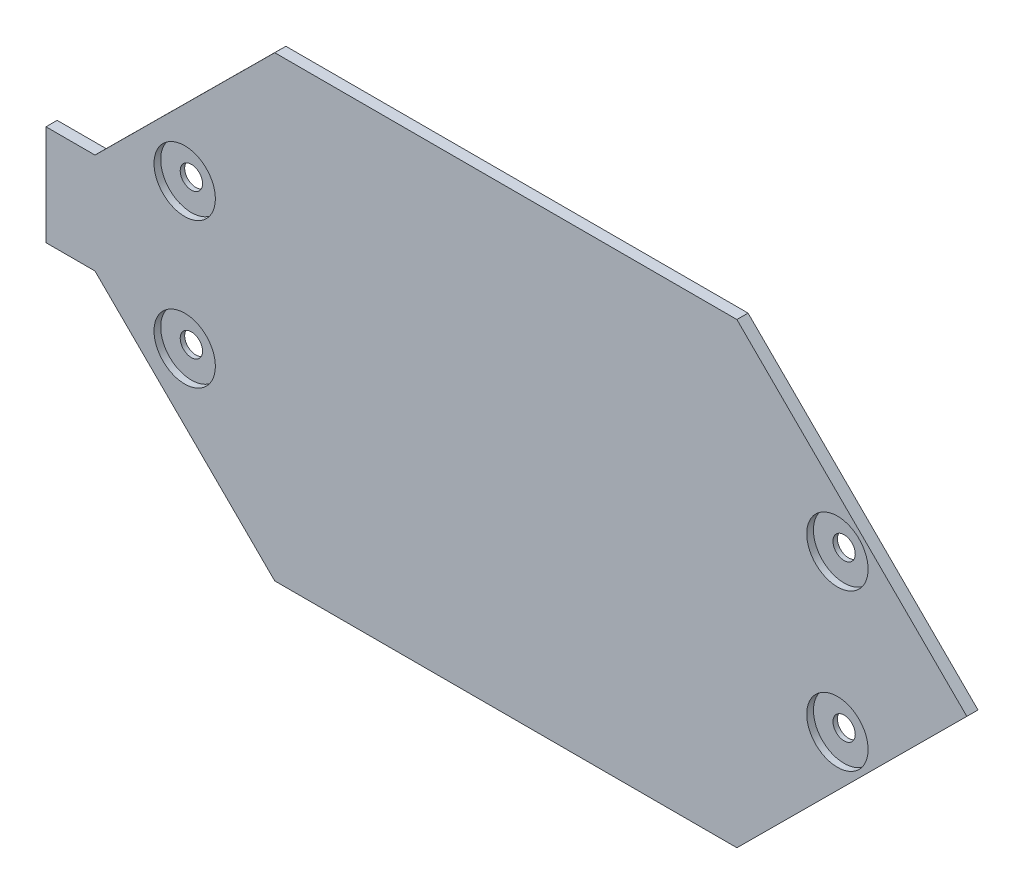
ISO-10303-21;
HEADER;
FILE_DESCRIPTION(('STEP AP214'),'2;1');
FILE_NAME('part.step','',(''),(''),'','','');
FILE_SCHEMA(('AUTOMOTIVE_DESIGN { 1 0 10303 214 1 1 1 1 }'));
ENDSEC;
DATA;
#1=APPLICATION_CONTEXT('core data for automotive mechanical design processes');
#2=APPLICATION_PROTOCOL_DEFINITION('international standard','automotive_design',2000,#1);
#3=PRODUCT_CONTEXT('',#1,'mechanical');
#4=PRODUCT('Part','Part','',(#3));
#5=PRODUCT_RELATED_PRODUCT_CATEGORY('part','',(#4));
#6=PRODUCT_DEFINITION_FORMATION('','',#4);
#7=PRODUCT_DEFINITION_CONTEXT('part definition',#1,'design');
#8=PRODUCT_DEFINITION('design','',#6,#7);
#9=PRODUCT_DEFINITION_SHAPE('','',#8);
#10=(LENGTH_UNIT() NAMED_UNIT(*) SI_UNIT(.MILLI.,.METRE.));
#11=(NAMED_UNIT(*) PLANE_ANGLE_UNIT() SI_UNIT($,.RADIAN.));
#12=(NAMED_UNIT(*) SI_UNIT($,.STERADIAN.) SOLID_ANGLE_UNIT());
#13=UNCERTAINTY_MEASURE_WITH_UNIT(LENGTH_MEASURE(1.E-05),#10,'distance_accuracy_value','');
#14=(GEOMETRIC_REPRESENTATION_CONTEXT(3) GLOBAL_UNCERTAINTY_ASSIGNED_CONTEXT((#13)) GLOBAL_UNIT_ASSIGNED_CONTEXT((#10,
#11,#12)) REPRESENTATION_CONTEXT('',''));
#15=CARTESIAN_POINT('',(0.,0.,0.));
#16=DIRECTION('',(0.,0.,1.));
#17=DIRECTION('',(1.,0.,0.));
#18=AXIS2_PLACEMENT_3D('',#15,#16,#17);
#19=CARTESIAN_POINT('',(24.5,59.53,1.));
#20=DIRECTION('',(0.,0.,-1.));
#21=DIRECTION('',(-1.,0.,0.));
#22=AXIS2_PLACEMENT_3D('',#19,#20,#21);
#23=CYLINDRICAL_SURFACE('',#22,1.);
#24=CARTESIAN_POINT('',(24.5,59.53,0.));
#25=DIRECTION('',(0.,0.,1.));
#26=DIRECTION('',(1.,0.,0.));
#27=AXIS2_PLACEMENT_3D('',#24,#25,#26);
#28=CIRCLE('',#27,1.);
#29=CARTESIAN_POINT('',(25.5,59.53,0.));
#30=VERTEX_POINT('',#29);
#31=EDGE_CURVE('E143',#30,#30,#28,.T.);
#32=ORIENTED_EDGE('',*,*,#31,.F.);
#33=EDGE_LOOP('',(#32));
#34=FACE_BOUND('',#33,.T.);
#35=CARTESIAN_POINT('',(24.5,59.53,0.4));
#36=DIRECTION('',(0.,0.,1.));
#37=DIRECTION('',(1.,0.,0.));
#38=AXIS2_PLACEMENT_3D('',#35,#36,#37);
#39=CIRCLE('',#38,1.);
#40=CARTESIAN_POINT('',(25.5,59.53,0.4));
#41=VERTEX_POINT('',#40);
#42=EDGE_CURVE('E38',#41,#41,#39,.T.);
#43=ORIENTED_EDGE('',*,*,#42,.T.);
#44=EDGE_LOOP('',(#43));
#45=FACE_BOUND('',#44,.T.);
#46=ADVANCED_FACE('F34',(#34,#45),#23,.F.);
#47=CARTESIAN_POINT('',(24.5,46.53,1.));
#48=DIRECTION('',(0.,0.,-1.));
#49=DIRECTION('',(-1.,0.,0.));
#50=AXIS2_PLACEMENT_3D('',#47,#48,#49);
#51=CYLINDRICAL_SURFACE('',#50,1.);
#52=CARTESIAN_POINT('',(24.5,46.53,0.));
#53=DIRECTION('',(0.,0.,1.));
#54=DIRECTION('',(1.,0.,0.));
#55=AXIS2_PLACEMENT_3D('',#52,#53,#54);
#56=CIRCLE('',#55,1.);
#57=CARTESIAN_POINT('',(25.5,46.53,0.));
#58=VERTEX_POINT('',#57);
#59=EDGE_CURVE('E191',#58,#58,#56,.T.);
#60=ORIENTED_EDGE('',*,*,#59,.F.);
#61=EDGE_LOOP('',(#60));
#62=FACE_BOUND('',#61,.T.);
#63=CARTESIAN_POINT('',(24.5,46.53,0.4));
#64=DIRECTION('',(0.,0.,1.));
#65=DIRECTION('',(1.,0.,0.));
#66=AXIS2_PLACEMENT_3D('',#63,#64,#65);
#67=CIRCLE('',#66,1.);
#68=CARTESIAN_POINT('',(25.5,46.53,0.4));
#69=VERTEX_POINT('',#68);
#70=EDGE_CURVE('E177',#69,#69,#67,.T.);
#71=ORIENTED_EDGE('',*,*,#70,.T.);
#72=EDGE_LOOP('',(#71));
#73=FACE_BOUND('',#72,.T.);
#74=ADVANCED_FACE('F240',(#62,#73),#51,.F.);
#75=CARTESIAN_POINT('',(83.,60.03,1.));
#76=DIRECTION('',(0.,0.,-1.));
#77=DIRECTION('',(-1.,0.,0.));
#78=AXIS2_PLACEMENT_3D('',#75,#76,#77);
#79=CYLINDRICAL_SURFACE('',#78,0.999999999999998);
#80=CARTESIAN_POINT('',(83.,60.03,0.));
#81=DIRECTION('',(0.,0.,1.));
#82=DIRECTION('',(1.,0.,0.));
#83=AXIS2_PLACEMENT_3D('',#80,#81,#82);
#84=CIRCLE('',#83,0.999999999999998);
#85=CARTESIAN_POINT('',(84.,60.03,0.));
#86=VERTEX_POINT('',#85);
#87=EDGE_CURVE('E186',#86,#86,#84,.T.);
#88=ORIENTED_EDGE('',*,*,#87,.F.);
#89=EDGE_LOOP('',(#88));
#90=FACE_BOUND('',#89,.T.);
#91=CARTESIAN_POINT('',(83.,60.03,0.4));
#92=DIRECTION('',(0.,0.,1.));
#93=DIRECTION('',(1.,0.,0.));
#94=AXIS2_PLACEMENT_3D('',#91,#92,#93);
#95=CIRCLE('',#94,0.999999999999998);
#96=CARTESIAN_POINT('',(84.,60.03,0.4));
#97=VERTEX_POINT('',#96);
#98=EDGE_CURVE('E174',#97,#97,#95,.T.);
#99=ORIENTED_EDGE('',*,*,#98,.T.);
#100=EDGE_LOOP('',(#99));
#101=FACE_BOUND('',#100,.T.);
#102=ADVANCED_FACE('F246',(#90,#101),#79,.F.);
#103=CARTESIAN_POINT('',(83.,46.03,1.));
#104=DIRECTION('',(0.,0.,-1.));
#105=DIRECTION('',(-1.,0.,0.));
#106=AXIS2_PLACEMENT_3D('',#103,#104,#105);
#107=CYLINDRICAL_SURFACE('',#106,0.999999999999998);
#108=CARTESIAN_POINT('',(83.,46.03,0.));
#109=DIRECTION('',(0.,0.,1.));
#110=DIRECTION('',(1.,0.,0.));
#111=AXIS2_PLACEMENT_3D('',#108,#109,#110);
#112=CIRCLE('',#111,0.999999999999998);
#113=CARTESIAN_POINT('',(84.,46.03,0.));
#114=VERTEX_POINT('',#113);
#115=EDGE_CURVE('E182',#114,#114,#112,.T.);
#116=ORIENTED_EDGE('',*,*,#115,.F.);
#117=EDGE_LOOP('',(#116));
#118=FACE_BOUND('',#117,.T.);
#119=CARTESIAN_POINT('',(83.,46.03,0.4));
#120=DIRECTION('',(0.,0.,1.));
#121=DIRECTION('',(1.,0.,0.));
#122=AXIS2_PLACEMENT_3D('',#119,#120,#121);
#123=CIRCLE('',#122,0.999999999999998);
#124=CARTESIAN_POINT('',(84.,46.03,0.4));
#125=VERTEX_POINT('',#124);
#126=EDGE_CURVE('E171',#125,#125,#123,.T.);
#127=ORIENTED_EDGE('',*,*,#126,.T.);
#128=EDGE_LOOP('',(#127));
#129=FACE_BOUND('',#128,.T.);
#130=ADVANCED_FACE('F253',(#118,#129),#107,.F.);
#131=CARTESIAN_POINT('',(0.,0.,1.));
#132=DIRECTION('',(0.,0.,1.));
#133=DIRECTION('',(1.,0.,0.));
#134=AXIS2_PLACEMENT_3D('',#131,#132,#133);
#135=PLANE('',#134);
#136=CARTESIAN_POINT('',(24.5,46.53,1.));
#137=DIRECTION('',(0.,0.,1.));
#138=DIRECTION('',(1.,0.,0.));
#139=AXIS2_PLACEMENT_3D('',#136,#137,#138);
#140=CIRCLE('',#139,2.75);
#141=CARTESIAN_POINT('',(27.25,46.53,1.));
#142=VERTEX_POINT('',#141);
#143=EDGE_CURVE('E417',#142,#142,#140,.T.);
#144=ORIENTED_EDGE('',*,*,#143,.F.);
#145=EDGE_LOOP('',(#144));
#146=FACE_BOUND('',#145,.T.);
#147=CARTESIAN_POINT('',(83.,60.03,1.));
#148=DIRECTION('',(0.,0.,1.));
#149=DIRECTION('',(1.,0.,0.));
#150=AXIS2_PLACEMENT_3D('',#147,#148,#149);
#151=CIRCLE('',#150,2.75000000000001);
#152=CARTESIAN_POINT('',(85.75,60.03,1.));
#153=VERTEX_POINT('',#152);
#154=EDGE_CURVE('E410',#153,#153,#151,.T.);
#155=ORIENTED_EDGE('',*,*,#154,.F.);
#156=EDGE_LOOP('',(#155));
#157=FACE_BOUND('',#156,.T.);
#158=CARTESIAN_POINT('',(83.,46.03,1.));
#159=DIRECTION('',(0.,0.,1.));
#160=DIRECTION('',(1.,0.,0.));
#161=AXIS2_PLACEMENT_3D('',#158,#159,#160);
#162=CIRCLE('',#161,2.75000000000001);
#163=CARTESIAN_POINT('',(85.75,46.03,1.));
#164=VERTEX_POINT('',#163);
#165=EDGE_CURVE('E422',#164,#164,#162,.T.);
#166=ORIENTED_EDGE('',*,*,#165,.F.);
#167=EDGE_LOOP('',(#166));
#168=FACE_BOUND('',#167,.T.);
#169=CARTESIAN_POINT('',(24.5,59.53,1.));
#170=DIRECTION('',(0.,0.,1.));
#171=DIRECTION('',(1.,0.,0.));
#172=AXIS2_PLACEMENT_3D('',#169,#170,#171);
#173=CIRCLE('',#172,2.75);
#174=CARTESIAN_POINT('',(27.25,59.53,1.));
#175=VERTEX_POINT('',#174);
#176=EDGE_CURVE('E194',#175,#175,#173,.T.);
#177=ORIENTED_EDGE('',*,*,#176,.F.);
#178=EDGE_LOOP('',(#177));
#179=FACE_BOUND('',#178,.T.);
#180=DIRECTION('',(0.708996282667242,0.705212217112007,0.));
#181=VECTOR('',#180,1.);
#182=CARTESIAN_POINT('',(73.99,32.53,1.));
#183=LINE('',#182,#181);
#184=CARTESIAN_POINT('',(73.99,32.53,1.));
#185=VERTEX_POINT('',#184);
#186=CARTESIAN_POINT('',(94.6,53.03,1.));
#187=VERTEX_POINT('',#186);
#188=EDGE_CURVE('E156',#185,#187,#183,.T.);
#189=ORIENTED_EDGE('',*,*,#188,.T.);
#190=DIRECTION('',(-0.708996282667242,0.705212217112007,0.));
#191=VECTOR('',#190,1.);
#192=CARTESIAN_POINT('',(94.6,53.03,1.));
#193=LINE('',#192,#191);
#194=CARTESIAN_POINT('',(73.99,73.53,1.));
#195=VERTEX_POINT('',#194);
#196=EDGE_CURVE('E99',#187,#195,#193,.T.);
#197=ORIENTED_EDGE('',*,*,#196,.T.);
#198=DIRECTION('',(-1.,0.,0.));
#199=VECTOR('',#198,1.);
#200=CARTESIAN_POINT('',(73.99,73.53,1.));
#201=LINE('',#200,#199);
#202=CARTESIAN_POINT('',(32.57,73.53,1.));
#203=VERTEX_POINT('',#202);
#204=EDGE_CURVE('E203',#195,#203,#201,.T.);
#205=ORIENTED_EDGE('',*,*,#204,.T.);
#206=DIRECTION('',(-0.709524970576153,-0.704680293557943,0.));
#207=VECTOR('',#206,1.);
#208=CARTESIAN_POINT('',(32.57,73.53,1.));
#209=LINE('',#208,#207);
#210=CARTESIAN_POINT('',(16.46,57.53,1.));
#211=VERTEX_POINT('',#210);
#212=EDGE_CURVE('E205',#203,#211,#209,.T.);
#213=ORIENTED_EDGE('',*,*,#212,.T.);
#214=DIRECTION('',(-1.,0.,0.));
#215=VECTOR('',#214,1.);
#216=CARTESIAN_POINT('',(12.07,57.53,1.));
#217=LINE('',#216,#215);
#218=CARTESIAN_POINT('',(12.07,57.53,1.));
#219=VERTEX_POINT('',#218);
#220=EDGE_CURVE('E207',#211,#219,#217,.T.);
#221=ORIENTED_EDGE('',*,*,#220,.T.);
#222=DIRECTION('',(0.,-1.,0.));
#223=VECTOR('',#222,1.);
#224=CARTESIAN_POINT('',(12.07,57.53,1.));
#225=LINE('',#224,#223);
#226=CARTESIAN_POINT('',(12.07,48.53,1.));
#227=VERTEX_POINT('',#226);
#228=EDGE_CURVE('E121',#219,#227,#225,.T.);
#229=ORIENTED_EDGE('',*,*,#228,.T.);
#230=DIRECTION('',(1.,0.,0.));
#231=VECTOR('',#230,1.);
#232=CARTESIAN_POINT('',(12.07,48.53,1.));
#233=LINE('',#232,#231);
#234=CARTESIAN_POINT('',(16.46,48.53,1.));
#235=VERTEX_POINT('',#234);
#236=EDGE_CURVE('E115',#227,#235,#233,.T.);
#237=ORIENTED_EDGE('',*,*,#236,.T.);
#238=DIRECTION('',(0.709524970576153,-0.704680293557943,0.));
#239=VECTOR('',#238,1.);
#240=CARTESIAN_POINT('',(16.46,48.53,1.));
#241=LINE('',#240,#239);
#242=CARTESIAN_POINT('',(32.57,32.53,1.));
#243=VERTEX_POINT('',#242);
#244=EDGE_CURVE('E119',#235,#243,#241,.T.);
#245=ORIENTED_EDGE('',*,*,#244,.T.);
#246=DIRECTION('',(1.,0.,0.));
#247=VECTOR('',#246,1.);
#248=CARTESIAN_POINT('',(32.57,32.53,1.));
#249=LINE('',#248,#247);
#250=EDGE_CURVE('E53',#243,#185,#249,.T.);
#251=ORIENTED_EDGE('',*,*,#250,.T.);
#252=EDGE_LOOP('',(#189,#197,#205,#213,#221,#229,#237,#245,#251));
#253=FACE_BOUND('',#252,.T.);
#254=ADVANCED_FACE('F117',(#146,#157,#168,#179,#253),#135,.T.);
#255=CARTESIAN_POINT('',(0.,0.,0.));
#256=DIRECTION('',(0.,0.,1.));
#257=DIRECTION('',(1.,0.,0.));
#258=AXIS2_PLACEMENT_3D('',#255,#256,#257);
#259=PLANE('',#258);
#260=DIRECTION('',(0.708996282667242,0.705212217112007,0.));
#261=VECTOR('',#260,1.);
#262=CARTESIAN_POINT('',(73.99,32.53,0.));
#263=LINE('',#262,#261);
#264=CARTESIAN_POINT('',(73.99,32.53,0.));
#265=VERTEX_POINT('',#264);
#266=CARTESIAN_POINT('',(94.6,53.03,0.));
#267=VERTEX_POINT('',#266);
#268=EDGE_CURVE('E139',#265,#267,#263,.T.);
#269=ORIENTED_EDGE('',*,*,#268,.F.);
#270=DIRECTION('',(1.,0.,0.));
#271=VECTOR('',#270,1.);
#272=CARTESIAN_POINT('',(32.57,32.53,0.));
#273=LINE('',#272,#271);
#274=CARTESIAN_POINT('',(32.57,32.53,0.));
#275=VERTEX_POINT('',#274);
#276=EDGE_CURVE('E91',#275,#265,#273,.T.);
#277=ORIENTED_EDGE('',*,*,#276,.F.);
#278=DIRECTION('',(0.709524970576153,-0.704680293557943,0.));
#279=VECTOR('',#278,1.);
#280=CARTESIAN_POINT('',(16.46,48.53,0.));
#281=LINE('',#280,#279);
#282=CARTESIAN_POINT('',(16.46,48.53,0.));
#283=VERTEX_POINT('',#282);
#284=EDGE_CURVE('E85',#283,#275,#281,.T.);
#285=ORIENTED_EDGE('',*,*,#284,.F.);
#286=DIRECTION('',(1.,0.,0.));
#287=VECTOR('',#286,1.);
#288=CARTESIAN_POINT('',(12.07,48.53,0.));
#289=LINE('',#288,#287);
#290=CARTESIAN_POINT('',(12.07,48.53,0.));
#291=VERTEX_POINT('',#290);
#292=EDGE_CURVE('E129',#291,#283,#289,.T.);
#293=ORIENTED_EDGE('',*,*,#292,.F.);
#294=DIRECTION('',(0.,-1.,0.));
#295=VECTOR('',#294,1.);
#296=CARTESIAN_POINT('',(12.07,57.53,0.));
#297=LINE('',#296,#295);
#298=CARTESIAN_POINT('',(12.07,57.53,0.));
#299=VERTEX_POINT('',#298);
#300=EDGE_CURVE('E151',#299,#291,#297,.T.);
#301=ORIENTED_EDGE('',*,*,#300,.F.);
#302=DIRECTION('',(-1.,0.,0.));
#303=VECTOR('',#302,1.);
#304=CARTESIAN_POINT('',(12.07,57.53,0.));
#305=LINE('',#304,#303);
#306=CARTESIAN_POINT('',(16.46,57.53,0.));
#307=VERTEX_POINT('',#306);
#308=EDGE_CURVE('E149',#307,#299,#305,.T.);
#309=ORIENTED_EDGE('',*,*,#308,.F.);
#310=DIRECTION('',(-0.709524970576153,-0.704680293557943,0.));
#311=VECTOR('',#310,1.);
#312=CARTESIAN_POINT('',(32.57,73.53,0.));
#313=LINE('',#312,#311);
#314=CARTESIAN_POINT('',(32.57,73.53,0.));
#315=VERTEX_POINT('',#314);
#316=EDGE_CURVE('E147',#315,#307,#313,.T.);
#317=ORIENTED_EDGE('',*,*,#316,.F.);
#318=DIRECTION('',(-1.,0.,0.));
#319=VECTOR('',#318,1.);
#320=CARTESIAN_POINT('',(73.99,73.53,0.));
#321=LINE('',#320,#319);
#322=CARTESIAN_POINT('',(73.99,73.53,0.));
#323=VERTEX_POINT('',#322);
#324=EDGE_CURVE('E145',#323,#315,#321,.T.);
#325=ORIENTED_EDGE('',*,*,#324,.F.);
#326=DIRECTION('',(-0.708996282667242,0.705212217112007,0.));
#327=VECTOR('',#326,1.);
#328=CARTESIAN_POINT('',(94.6,53.03,0.));
#329=LINE('',#328,#327);
#330=EDGE_CURVE('E142',#267,#323,#329,.T.);
#331=ORIENTED_EDGE('',*,*,#330,.F.);
#332=EDGE_LOOP('',(#269,#277,#285,#293,#301,#309,#317,#325,#331));
#333=FACE_BOUND('',#332,.T.);
#334=ORIENTED_EDGE('',*,*,#31,.T.);
#335=EDGE_LOOP('',(#334));
#336=FACE_BOUND('',#335,.T.);
#337=ORIENTED_EDGE('',*,*,#59,.T.);
#338=EDGE_LOOP('',(#337));
#339=FACE_BOUND('',#338,.T.);
#340=ORIENTED_EDGE('',*,*,#87,.T.);
#341=EDGE_LOOP('',(#340));
#342=FACE_BOUND('',#341,.T.);
#343=ORIENTED_EDGE('',*,*,#115,.T.);
#344=EDGE_LOOP('',(#343));
#345=FACE_BOUND('',#344,.T.);
#346=ADVANCED_FACE('F220',(#333,#336,#339,#342,#345),#259,.F.);
#347=CARTESIAN_POINT('',(73.99,32.53,1.));
#348=DIRECTION('',(-0.705212217112007,0.708996282667242,0.));
#349=DIRECTION('',(-0.708996282667242,-0.705212217112007,0.));
#350=AXIS2_PLACEMENT_3D('',#347,#348,#349);
#351=PLANE('',#350);
#352=ORIENTED_EDGE('',*,*,#268,.T.);
#353=DIRECTION('',(0.,0.,-1.));
#354=VECTOR('',#353,1.);
#355=CARTESIAN_POINT('',(94.6,53.03,1.));
#356=LINE('',#355,#354);
#357=EDGE_CURVE('E11',#187,#267,#356,.T.);
#358=ORIENTED_EDGE('',*,*,#357,.F.);
#359=ORIENTED_EDGE('',*,*,#188,.F.);
#360=DIRECTION('',(0.,0.,-1.));
#361=VECTOR('',#360,1.);
#362=CARTESIAN_POINT('',(73.99,32.53,1.));
#363=LINE('',#362,#361);
#364=EDGE_CURVE('E135',#185,#265,#363,.T.);
#365=ORIENTED_EDGE('',*,*,#364,.T.);
#366=EDGE_LOOP('',(#352,#358,#359,#365));
#367=FACE_BOUND('',#366,.T.);
#368=ADVANCED_FACE('F36',(#367),#351,.F.);
#369=CARTESIAN_POINT('',(94.6,53.03,1.));
#370=DIRECTION('',(-0.705212217112007,-0.708996282667242,0.));
#371=DIRECTION('',(0.708996282667242,-0.705212217112007,0.));
#372=AXIS2_PLACEMENT_3D('',#369,#370,#371);
#373=PLANE('',#372);
#374=ORIENTED_EDGE('',*,*,#330,.T.);
#375=DIRECTION('',(0.,0.,-1.));
#376=VECTOR('',#375,1.);
#377=CARTESIAN_POINT('',(73.99,73.53,1.));
#378=LINE('',#377,#376);
#379=EDGE_CURVE('E44',#195,#323,#378,.T.);
#380=ORIENTED_EDGE('',*,*,#379,.F.);
#381=ORIENTED_EDGE('',*,*,#196,.F.);
#382=ORIENTED_EDGE('',*,*,#357,.T.);
#383=EDGE_LOOP('',(#374,#380,#381,#382));
#384=FACE_BOUND('',#383,.T.);
#385=ADVANCED_FACE('F259',(#384),#373,.F.);
#386=CARTESIAN_POINT('',(73.99,73.53,1.));
#387=DIRECTION('',(0.,-1.,0.));
#388=DIRECTION('',(1.,0.,0.));
#389=AXIS2_PLACEMENT_3D('',#386,#387,#388);
#390=PLANE('',#389);
#391=ORIENTED_EDGE('',*,*,#324,.T.);
#392=DIRECTION('',(0.,0.,-1.));
#393=VECTOR('',#392,1.);
#394=CARTESIAN_POINT('',(32.57,73.53,1.));
#395=LINE('',#394,#393);
#396=EDGE_CURVE('E166',#203,#315,#395,.T.);
#397=ORIENTED_EDGE('',*,*,#396,.F.);
#398=ORIENTED_EDGE('',*,*,#204,.F.);
#399=ORIENTED_EDGE('',*,*,#379,.T.);
#400=EDGE_LOOP('',(#391,#397,#398,#399));
#401=FACE_BOUND('',#400,.T.);
#402=ADVANCED_FACE('F263',(#401),#390,.F.);
#403=CARTESIAN_POINT('',(32.57,73.53,1.));
#404=DIRECTION('',(0.704680293557943,-0.709524970576154,0.));
#405=DIRECTION('',(0.709524970576154,0.704680293557943,0.));
#406=AXIS2_PLACEMENT_3D('',#403,#404,#405);
#407=PLANE('',#406);
#408=ORIENTED_EDGE('',*,*,#316,.T.);
#409=DIRECTION('',(0.,0.,-1.));
#410=VECTOR('',#409,1.);
#411=CARTESIAN_POINT('',(16.46,57.53,1.));
#412=LINE('',#411,#410);
#413=EDGE_CURVE('E163',#211,#307,#412,.T.);
#414=ORIENTED_EDGE('',*,*,#413,.F.);
#415=ORIENTED_EDGE('',*,*,#212,.F.);
#416=ORIENTED_EDGE('',*,*,#396,.T.);
#417=EDGE_LOOP('',(#408,#414,#415,#416));
#418=FACE_BOUND('',#417,.T.);
#419=ADVANCED_FACE('F267',(#418),#407,.F.);
#420=CARTESIAN_POINT('',(12.07,57.53,1.));
#421=DIRECTION('',(0.,-1.,0.));
#422=DIRECTION('',(0.,0.,-1.));
#423=AXIS2_PLACEMENT_3D('',#420,#421,#422);
#424=PLANE('',#423);
#425=ORIENTED_EDGE('',*,*,#308,.T.);
#426=DIRECTION('',(0.,0.,-1.));
#427=VECTOR('',#426,1.);
#428=CARTESIAN_POINT('',(12.07,57.53,1.));
#429=LINE('',#428,#427);
#430=EDGE_CURVE('E160',#219,#299,#429,.T.);
#431=ORIENTED_EDGE('',*,*,#430,.F.);
#432=ORIENTED_EDGE('',*,*,#220,.F.);
#433=ORIENTED_EDGE('',*,*,#413,.T.);
#434=EDGE_LOOP('',(#425,#431,#432,#433));
#435=FACE_BOUND('',#434,.T.);
#436=ADVANCED_FACE('F213',(#435),#424,.F.);
#437=CARTESIAN_POINT('',(12.07,57.53,1.));
#438=DIRECTION('',(1.,0.,0.));
#439=DIRECTION('',(0.,1.,0.));
#440=AXIS2_PLACEMENT_3D('',#437,#438,#439);
#441=PLANE('',#440);
#442=ORIENTED_EDGE('',*,*,#300,.T.);
#443=DIRECTION('',(0.,0.,-1.));
#444=VECTOR('',#443,1.);
#445=CARTESIAN_POINT('',(12.07,48.53,1.));
#446=LINE('',#445,#444);
#447=EDGE_CURVE('E130',#227,#291,#446,.T.);
#448=ORIENTED_EDGE('',*,*,#447,.F.);
#449=ORIENTED_EDGE('',*,*,#228,.F.);
#450=ORIENTED_EDGE('',*,*,#430,.T.);
#451=EDGE_LOOP('',(#442,#448,#449,#450));
#452=FACE_BOUND('',#451,.T.);
#453=ADVANCED_FACE('F217',(#452),#441,.F.);
#454=CARTESIAN_POINT('',(12.07,48.53,1.));
#455=DIRECTION('',(0.,1.,0.));
#456=DIRECTION('',(0.,0.,1.));
#457=AXIS2_PLACEMENT_3D('',#454,#455,#456);
#458=PLANE('',#457);
#459=ORIENTED_EDGE('',*,*,#292,.T.);
#460=DIRECTION('',(0.,0.,-1.));
#461=VECTOR('',#460,1.);
#462=CARTESIAN_POINT('',(16.46,48.53,1.));
#463=LINE('',#462,#461);
#464=EDGE_CURVE('E126',#235,#283,#463,.T.);
#465=ORIENTED_EDGE('',*,*,#464,.F.);
#466=ORIENTED_EDGE('',*,*,#236,.F.);
#467=ORIENTED_EDGE('',*,*,#447,.T.);
#468=EDGE_LOOP('',(#459,#465,#466,#467));
#469=FACE_BOUND('',#468,.T.);
#470=ADVANCED_FACE('F127',(#469),#458,.F.);
#471=CARTESIAN_POINT('',(16.46,48.53,1.));
#472=DIRECTION('',(0.704680293557943,0.709524970576154,0.));
#473=DIRECTION('',(-0.709524970576154,0.704680293557943,0.));
#474=AXIS2_PLACEMENT_3D('',#471,#472,#473);
#475=PLANE('',#474);
#476=ORIENTED_EDGE('',*,*,#284,.T.);
#477=DIRECTION('',(0.,0.,-1.));
#478=VECTOR('',#477,1.);
#479=CARTESIAN_POINT('',(32.57,32.53,1.));
#480=LINE('',#479,#478);
#481=EDGE_CURVE('E131',#243,#275,#480,.T.);
#482=ORIENTED_EDGE('',*,*,#481,.F.);
#483=ORIENTED_EDGE('',*,*,#244,.F.);
#484=ORIENTED_EDGE('',*,*,#464,.T.);
#485=EDGE_LOOP('',(#476,#482,#483,#484));
#486=FACE_BOUND('',#485,.T.);
#487=ADVANCED_FACE('F133',(#486),#475,.F.);
#488=CARTESIAN_POINT('',(32.57,32.53,1.));
#489=DIRECTION('',(0.,1.,0.));
#490=DIRECTION('',(0.,0.,1.));
#491=AXIS2_PLACEMENT_3D('',#488,#489,#490);
#492=PLANE('',#491);
#493=ORIENTED_EDGE('',*,*,#276,.T.);
#494=ORIENTED_EDGE('',*,*,#364,.F.);
#495=ORIENTED_EDGE('',*,*,#250,.F.);
#496=ORIENTED_EDGE('',*,*,#481,.T.);
#497=EDGE_LOOP('',(#493,#494,#495,#496));
#498=FACE_BOUND('',#497,.T.);
#499=ADVANCED_FACE('F226',(#498),#492,.F.);
#500=CARTESIAN_POINT('',(83.,46.03,0.4));
#501=DIRECTION('',(0.,0.,1.));
#502=DIRECTION('',(1.,0.,0.));
#503=AXIS2_PLACEMENT_3D('',#500,#501,#502);
#504=CYLINDRICAL_SURFACE('',#503,2.75000000000001);
#505=CARTESIAN_POINT('',(83.,46.03,0.4));
#506=DIRECTION('',(0.,0.,1.));
#507=DIRECTION('',(1.,0.,0.));
#508=AXIS2_PLACEMENT_3D('',#505,#506,#507);
#509=CIRCLE('',#508,2.75000000000001);
#510=CARTESIAN_POINT('',(85.75,46.03,0.4));
#511=VERTEX_POINT('',#510);
#512=EDGE_CURVE('E414',#511,#511,#509,.T.);
#513=ORIENTED_EDGE('',*,*,#512,.F.);
#514=EDGE_LOOP('',(#513));
#515=FACE_BOUND('',#514,.T.);
#516=ORIENTED_EDGE('',*,*,#165,.T.);
#517=EDGE_LOOP('',(#516));
#518=FACE_BOUND('',#517,.T.);
#519=ADVANCED_FACE('F228',(#515,#518),#504,.F.);
#520=CARTESIAN_POINT('',(83.,46.03,0.4));
#521=DIRECTION('',(0.,0.,1.));
#522=DIRECTION('',(1.,0.,0.));
#523=AXIS2_PLACEMENT_3D('',#520,#521,#522);
#524=PLANE('',#523);
#525=ORIENTED_EDGE('',*,*,#126,.F.);
#526=EDGE_LOOP('',(#525));
#527=FACE_BOUND('',#526,.T.);
#528=ORIENTED_EDGE('',*,*,#512,.T.);
#529=EDGE_LOOP('',(#528));
#530=FACE_BOUND('',#529,.T.);
#531=ADVANCED_FACE('F234',(#527,#530),#524,.T.);
#532=CARTESIAN_POINT('',(83.,60.03,0.4));
#533=DIRECTION('',(0.,0.,1.));
#534=DIRECTION('',(1.,0.,0.));
#535=AXIS2_PLACEMENT_3D('',#532,#533,#534);
#536=CYLINDRICAL_SURFACE('',#535,2.75000000000001);
#537=CARTESIAN_POINT('',(83.,60.03,0.4));
#538=DIRECTION('',(0.,0.,1.));
#539=DIRECTION('',(1.,0.,0.));
#540=AXIS2_PLACEMENT_3D('',#537,#538,#539);
#541=CIRCLE('',#540,2.75000000000001);
#542=CARTESIAN_POINT('',(85.75,60.03,0.4));
#543=VERTEX_POINT('',#542);
#544=EDGE_CURVE('E413',#543,#543,#541,.T.);
#545=ORIENTED_EDGE('',*,*,#544,.F.);
#546=EDGE_LOOP('',(#545));
#547=FACE_BOUND('',#546,.T.);
#548=ORIENTED_EDGE('',*,*,#154,.T.);
#549=EDGE_LOOP('',(#548));
#550=FACE_BOUND('',#549,.T.);
#551=ADVANCED_FACE('F340',(#547,#550),#536,.F.);
#552=CARTESIAN_POINT('',(83.,60.03,0.4));
#553=DIRECTION('',(0.,0.,1.));
#554=DIRECTION('',(1.,0.,0.));
#555=AXIS2_PLACEMENT_3D('',#552,#553,#554);
#556=PLANE('',#555);
#557=ORIENTED_EDGE('',*,*,#98,.F.);
#558=EDGE_LOOP('',(#557));
#559=FACE_BOUND('',#558,.T.);
#560=ORIENTED_EDGE('',*,*,#544,.T.);
#561=EDGE_LOOP('',(#560));
#562=FACE_BOUND('',#561,.T.);
#563=ADVANCED_FACE('F350',(#559,#562),#556,.T.);
#564=CARTESIAN_POINT('',(24.5,46.53,0.4));
#565=DIRECTION('',(0.,0.,1.));
#566=DIRECTION('',(1.,0.,0.));
#567=AXIS2_PLACEMENT_3D('',#564,#565,#566);
#568=CYLINDRICAL_SURFACE('',#567,2.75);
#569=CARTESIAN_POINT('',(24.5,46.53,0.4));
#570=DIRECTION('',(0.,0.,1.));
#571=DIRECTION('',(1.,0.,0.));
#572=AXIS2_PLACEMENT_3D('',#569,#570,#571);
#573=CIRCLE('',#572,2.75);
#574=CARTESIAN_POINT('',(27.25,46.53,0.4));
#575=VERTEX_POINT('',#574);
#576=EDGE_CURVE('E408',#575,#575,#573,.T.);
#577=ORIENTED_EDGE('',*,*,#576,.F.);
#578=EDGE_LOOP('',(#577));
#579=FACE_BOUND('',#578,.T.);
#580=ORIENTED_EDGE('',*,*,#143,.T.);
#581=EDGE_LOOP('',(#580));
#582=FACE_BOUND('',#581,.T.);
#583=ADVANCED_FACE('F360',(#579,#582),#568,.F.);
#584=CARTESIAN_POINT('',(24.5,46.53,0.4));
#585=DIRECTION('',(0.,0.,1.));
#586=DIRECTION('',(1.,0.,0.));
#587=AXIS2_PLACEMENT_3D('',#584,#585,#586);
#588=PLANE('',#587);
#589=ORIENTED_EDGE('',*,*,#70,.F.);
#590=EDGE_LOOP('',(#589));
#591=FACE_BOUND('',#590,.T.);
#592=ORIENTED_EDGE('',*,*,#576,.T.);
#593=EDGE_LOOP('',(#592));
#594=FACE_BOUND('',#593,.T.);
#595=ADVANCED_FACE('F370',(#591,#594),#588,.T.);
#596=CARTESIAN_POINT('',(24.5,59.53,0.4));
#597=DIRECTION('',(0.,0.,1.));
#598=DIRECTION('',(1.,0.,0.));
#599=AXIS2_PLACEMENT_3D('',#596,#597,#598);
#600=CYLINDRICAL_SURFACE('',#599,2.75);
#601=CARTESIAN_POINT('',(24.5,59.53,0.4));
#602=DIRECTION('',(0.,0.,1.));
#603=DIRECTION('',(1.,0.,0.));
#604=AXIS2_PLACEMENT_3D('',#601,#602,#603);
#605=CIRCLE('',#604,2.75);
#606=CARTESIAN_POINT('',(27.25,59.53,0.4));
#607=VERTEX_POINT('',#606);
#608=EDGE_CURVE('E175',#607,#607,#605,.T.);
#609=ORIENTED_EDGE('',*,*,#608,.F.);
#610=EDGE_LOOP('',(#609));
#611=FACE_BOUND('',#610,.T.);
#612=ORIENTED_EDGE('',*,*,#176,.T.);
#613=EDGE_LOOP('',(#612));
#614=FACE_BOUND('',#613,.T.);
#615=ADVANCED_FACE('F380',(#611,#614),#600,.F.);
#616=CARTESIAN_POINT('',(24.5,59.53,0.4));
#617=DIRECTION('',(0.,0.,1.));
#618=DIRECTION('',(1.,0.,0.));
#619=AXIS2_PLACEMENT_3D('',#616,#617,#618);
#620=PLANE('',#619);
#621=ORIENTED_EDGE('',*,*,#42,.F.);
#622=EDGE_LOOP('',(#621));
#623=FACE_BOUND('',#622,.T.);
#624=ORIENTED_EDGE('',*,*,#608,.T.);
#625=EDGE_LOOP('',(#624));
#626=FACE_BOUND('',#625,.T.);
#627=ADVANCED_FACE('F390',(#623,#626),#620,.T.);
#628=CLOSED_SHELL('',(#46,#74,#102,#130,#254,#346,#368,#385,#402,#419,#436,#453,#470,#487,#499,
#519,#531,#551,#563,#583,#595,#615,#627));
#629=MANIFOLD_SOLID_BREP('B2',#628);
#630=ADVANCED_BREP_SHAPE_REPRESENTATION('',(#18,#629),#14);
#631=SHAPE_DEFINITION_REPRESENTATION(#9,#630);
ENDSEC;
END-ISO-10303-21;
